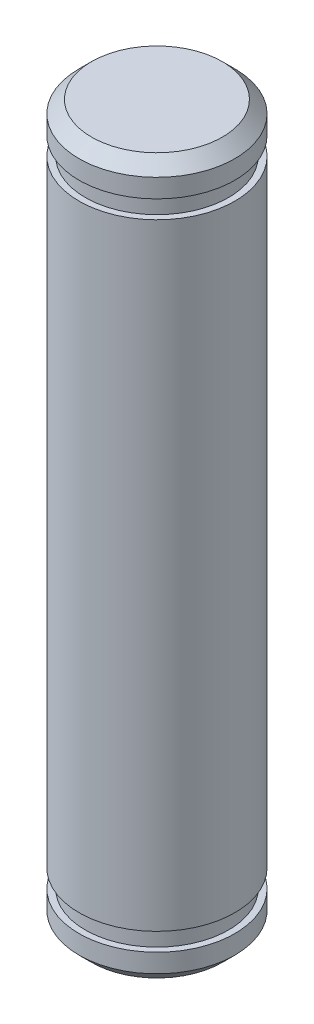
ISO-10303-21;
HEADER;
FILE_DESCRIPTION(('STEP AP214'),'2;1');
FILE_NAME('part.step','',(''),(''),'','','');
FILE_SCHEMA(('AUTOMOTIVE_DESIGN { 1 0 10303 214 1 1 1 1 }'));
ENDSEC;
DATA;
#1=APPLICATION_CONTEXT('core data for automotive mechanical design processes');
#2=APPLICATION_PROTOCOL_DEFINITION('international standard','automotive_design',2000,#1);
#3=PRODUCT_CONTEXT('',#1,'mechanical');
#4=PRODUCT('Part','Part','',(#3));
#5=PRODUCT_RELATED_PRODUCT_CATEGORY('part','',(#4));
#6=PRODUCT_DEFINITION_FORMATION('','',#4);
#7=PRODUCT_DEFINITION_CONTEXT('part definition',#1,'design');
#8=PRODUCT_DEFINITION('design','',#6,#7);
#9=PRODUCT_DEFINITION_SHAPE('','',#8);
#10=(LENGTH_UNIT() NAMED_UNIT(*) SI_UNIT(.MILLI.,.METRE.));
#11=(NAMED_UNIT(*) PLANE_ANGLE_UNIT() SI_UNIT($,.RADIAN.));
#12=(NAMED_UNIT(*) SI_UNIT($,.STERADIAN.) SOLID_ANGLE_UNIT());
#13=UNCERTAINTY_MEASURE_WITH_UNIT(LENGTH_MEASURE(1.E-05),#10,'distance_accuracy_value','');
#14=(GEOMETRIC_REPRESENTATION_CONTEXT(3) GLOBAL_UNCERTAINTY_ASSIGNED_CONTEXT((#13)) GLOBAL_UNIT_ASSIGNED_CONTEXT((#10,
#11,#12)) REPRESENTATION_CONTEXT('',''));
#15=CARTESIAN_POINT('',(0.,0.,0.));
#16=DIRECTION('',(0.,0.,1.));
#17=DIRECTION('',(1.,0.,0.));
#18=AXIS2_PLACEMENT_3D('',#15,#16,#17);
#19=CARTESIAN_POINT('',(0.,-14.5669,0.));
#20=DIRECTION('',(0.,-1.,0.));
#21=DIRECTION('',(1.,0.,0.));
#22=AXIS2_PLACEMENT_3D('',#19,#20,#21);
#23=PLANE('',#22);
#24=CARTESIAN_POINT('',(0.,-14.5669,0.));
#25=DIRECTION('',(0.,-1.,0.));
#26=DIRECTION('',(1.,0.,0.));
#27=AXIS2_PLACEMENT_3D('',#24,#25,#26);
#28=CIRCLE('',#27,2.66699999999991);
#29=CARTESIAN_POINT('',(2.66699999999983,-14.5669,0.));
#30=VERTEX_POINT('',#29);
#31=EDGE_CURVE('E56',#30,#30,#28,.T.);
#32=ORIENTED_EDGE('',*,*,#31,.T.);
#33=EDGE_LOOP('',(#32));
#34=FACE_BOUND('',#33,.T.);
#35=ADVANCED_FACE('F45',(#34),#23,.T.);
#36=CARTESIAN_POINT('',(0.,14.5669,0.));
#37=DIRECTION('',(0.,1.,0.));
#38=DIRECTION('',(-1.,0.,0.));
#39=AXIS2_PLACEMENT_3D('',#36,#37,#38);
#40=CYLINDRICAL_SURFACE('',#39,3.17499999999992);
#41=CARTESIAN_POINT('',(0.,-14.0589,0.));
#42=DIRECTION('',(0.,-1.,0.));
#43=DIRECTION('',(1.,0.,0.));
#44=AXIS2_PLACEMENT_3D('',#41,#42,#43);
#45=CIRCLE('',#44,3.17499999999992);
#46=CARTESIAN_POINT('',(3.17499999999984,-14.0589,0.));
#47=VERTEX_POINT('',#46);
#48=EDGE_CURVE('E60',#47,#47,#45,.F.);
#49=ORIENTED_EDGE('',*,*,#48,.T.);
#50=EDGE_LOOP('',(#49));
#51=FACE_BOUND('',#50,.T.);
#52=CARTESIAN_POINT('',(0.,-13.2969,0.));
#53=DIRECTION('',(0.,1.,0.));
#54=DIRECTION('',(-1.,0.,0.));
#55=AXIS2_PLACEMENT_3D('',#52,#53,#54);
#56=CIRCLE('',#55,3.17499999999992);
#57=CARTESIAN_POINT('',(-3.175,-13.2969,0.));
#58=VERTEX_POINT('',#57);
#59=EDGE_CURVE('E65',#58,#58,#56,.T.);
#60=ORIENTED_EDGE('',*,*,#59,.F.);
#61=EDGE_LOOP('',(#60));
#62=FACE_BOUND('',#61,.T.);
#63=ADVANCED_FACE('F107',(#51,#62),#40,.T.);
#64=CARTESIAN_POINT('',(-3.175,-13.2969,0.));
#65=DIRECTION('',(0.,1.,0.));
#66=DIRECTION('',(-1.,0.,0.));
#67=AXIS2_PLACEMENT_3D('',#64,#65,#66);
#68=PLANE('',#67);
#69=ORIENTED_EDGE('',*,*,#59,.T.);
#70=EDGE_LOOP('',(#69));
#71=FACE_BOUND('',#70,.T.);
#72=CARTESIAN_POINT('',(0.,-13.2969,0.));
#73=DIRECTION('',(0.,1.,0.));
#74=DIRECTION('',(-1.,0.,0.));
#75=AXIS2_PLACEMENT_3D('',#72,#73,#74);
#76=CIRCLE('',#75,2.92099999999992);
#77=CARTESIAN_POINT('',(-2.921,-13.2969,0.));
#78=VERTEX_POINT('',#77);
#79=EDGE_CURVE('E68',#78,#78,#76,.T.);
#80=ORIENTED_EDGE('',*,*,#79,.F.);
#81=EDGE_LOOP('',(#80));
#82=FACE_BOUND('',#81,.T.);
#83=ADVANCED_FACE('F113',(#71,#82),#68,.T.);
#84=CARTESIAN_POINT('',(0.,14.5669,0.));
#85=DIRECTION('',(0.,1.,0.));
#86=DIRECTION('',(-1.,0.,0.));
#87=AXIS2_PLACEMENT_3D('',#84,#85,#86);
#88=CYLINDRICAL_SURFACE('',#87,2.92099999999992);
#89=ORIENTED_EDGE('',*,*,#79,.T.);
#90=EDGE_LOOP('',(#89));
#91=FACE_BOUND('',#90,.T.);
#92=CARTESIAN_POINT('',(0.,-12.5603,0.));
#93=DIRECTION('',(0.,1.,0.));
#94=DIRECTION('',(-1.,0.,0.));
#95=AXIS2_PLACEMENT_3D('',#92,#93,#94);
#96=CIRCLE('',#95,2.92099999999992);
#97=CARTESIAN_POINT('',(-2.921,-12.5603,0.));
#98=VERTEX_POINT('',#97);
#99=EDGE_CURVE('E71',#98,#98,#96,.T.);
#100=ORIENTED_EDGE('',*,*,#99,.F.);
#101=EDGE_LOOP('',(#100));
#102=FACE_BOUND('',#101,.T.);
#103=ADVANCED_FACE('F134',(#91,#102),#88,.T.);
#104=CARTESIAN_POINT('',(-3.175,-12.5603,0.));
#105=DIRECTION('',(0.,-1.,0.));
#106=DIRECTION('',(1.,0.,0.));
#107=AXIS2_PLACEMENT_3D('',#104,#105,#106);
#108=PLANE('',#107);
#109=ORIENTED_EDGE('',*,*,#99,.T.);
#110=EDGE_LOOP('',(#109));
#111=FACE_BOUND('',#110,.T.);
#112=CARTESIAN_POINT('',(0.,-12.5603,0.));
#113=DIRECTION('',(0.,1.,0.));
#114=DIRECTION('',(-1.,0.,0.));
#115=AXIS2_PLACEMENT_3D('',#112,#113,#114);
#116=CIRCLE('',#115,3.17499999999992);
#117=CARTESIAN_POINT('',(-3.175,-12.5603,0.));
#118=VERTEX_POINT('',#117);
#119=EDGE_CURVE('E74',#118,#118,#116,.T.);
#120=ORIENTED_EDGE('',*,*,#119,.F.);
#121=EDGE_LOOP('',(#120));
#122=FACE_BOUND('',#121,.T.);
#123=ADVANCED_FACE('F139',(#111,#122),#108,.T.);
#124=CARTESIAN_POINT('',(0.,14.5669,0.));
#125=DIRECTION('',(0.,1.,0.));
#126=DIRECTION('',(-1.,0.,0.));
#127=AXIS2_PLACEMENT_3D('',#124,#125,#126);
#128=CYLINDRICAL_SURFACE('',#127,3.17499999999996);
#129=ORIENTED_EDGE('',*,*,#119,.T.);
#130=EDGE_LOOP('',(#129));
#131=FACE_BOUND('',#130,.T.);
#132=CARTESIAN_POINT('',(0.,12.5603,0.));
#133=DIRECTION('',(0.,1.,0.));
#134=DIRECTION('',(-1.,0.,0.));
#135=AXIS2_PLACEMENT_3D('',#132,#133,#134);
#136=CIRCLE('',#135,3.17499999999999);
#137=CARTESIAN_POINT('',(-3.175,12.5603,0.));
#138=VERTEX_POINT('',#137);
#139=EDGE_CURVE('E77',#138,#138,#136,.T.);
#140=ORIENTED_EDGE('',*,*,#139,.F.);
#141=EDGE_LOOP('',(#140));
#142=FACE_BOUND('',#141,.T.);
#143=ADVANCED_FACE('F145',(#131,#142),#128,.T.);
#144=CARTESIAN_POINT('',(-3.175,12.5603,0.));
#145=DIRECTION('',(0.,1.,0.));
#146=DIRECTION('',(-1.,0.,0.));
#147=AXIS2_PLACEMENT_3D('',#144,#145,#146);
#148=PLANE('',#147);
#149=ORIENTED_EDGE('',*,*,#139,.T.);
#150=EDGE_LOOP('',(#149));
#151=FACE_BOUND('',#150,.T.);
#152=CARTESIAN_POINT('',(0.,12.5603,0.));
#153=DIRECTION('',(0.,1.,0.));
#154=DIRECTION('',(-1.,0.,0.));
#155=AXIS2_PLACEMENT_3D('',#152,#153,#154);
#156=CIRCLE('',#155,2.92099999999999);
#157=CARTESIAN_POINT('',(-2.921,12.5603,0.));
#158=VERTEX_POINT('',#157);
#159=EDGE_CURVE('E80',#158,#158,#156,.T.);
#160=ORIENTED_EDGE('',*,*,#159,.F.);
#161=EDGE_LOOP('',(#160));
#162=FACE_BOUND('',#161,.T.);
#163=ADVANCED_FACE('F103',(#151,#162),#148,.T.);
#164=CARTESIAN_POINT('',(0.,14.5669,0.));
#165=DIRECTION('',(0.,1.,0.));
#166=DIRECTION('',(-1.,0.,0.));
#167=AXIS2_PLACEMENT_3D('',#164,#165,#166);
#168=CYLINDRICAL_SURFACE('',#167,2.921);
#169=ORIENTED_EDGE('',*,*,#159,.T.);
#170=EDGE_LOOP('',(#169));
#171=FACE_BOUND('',#170,.T.);
#172=CARTESIAN_POINT('',(0.,13.2969,0.));
#173=DIRECTION('',(0.,1.,0.));
#174=DIRECTION('',(-1.,0.,0.));
#175=AXIS2_PLACEMENT_3D('',#172,#173,#174);
#176=CIRCLE('',#175,2.921);
#177=CARTESIAN_POINT('',(-2.921,13.2969,0.));
#178=VERTEX_POINT('',#177);
#179=EDGE_CURVE('E83',#178,#178,#176,.T.);
#180=ORIENTED_EDGE('',*,*,#179,.F.);
#181=EDGE_LOOP('',(#180));
#182=FACE_BOUND('',#181,.T.);
#183=ADVANCED_FACE('F94',(#171,#182),#168,.T.);
#184=CARTESIAN_POINT('',(-3.175,13.2969,0.));
#185=DIRECTION('',(0.,-1.,0.));
#186=DIRECTION('',(1.,0.,0.));
#187=AXIS2_PLACEMENT_3D('',#184,#185,#186);
#188=PLANE('',#187);
#189=ORIENTED_EDGE('',*,*,#179,.T.);
#190=EDGE_LOOP('',(#189));
#191=FACE_BOUND('',#190,.T.);
#192=CARTESIAN_POINT('',(0.,13.2969,0.));
#193=DIRECTION('',(0.,1.,0.));
#194=DIRECTION('',(-1.,0.,0.));
#195=AXIS2_PLACEMENT_3D('',#192,#193,#194);
#196=CIRCLE('',#195,3.175);
#197=CARTESIAN_POINT('',(-3.175,13.2969,0.));
#198=VERTEX_POINT('',#197);
#199=EDGE_CURVE('E86',#198,#198,#196,.T.);
#200=ORIENTED_EDGE('',*,*,#199,.F.);
#201=EDGE_LOOP('',(#200));
#202=FACE_BOUND('',#201,.T.);
#203=ADVANCED_FACE('F92',(#191,#202),#188,.T.);
#204=CARTESIAN_POINT('',(0.,14.5669,0.));
#205=DIRECTION('',(0.,1.,0.));
#206=DIRECTION('',(-1.,0.,0.));
#207=AXIS2_PLACEMENT_3D('',#204,#205,#206);
#208=CYLINDRICAL_SURFACE('',#207,3.175);
#209=CARTESIAN_POINT('',(0.,14.0589,0.));
#210=DIRECTION('',(0.,1.,0.));
#211=DIRECTION('',(-1.,0.,0.));
#212=AXIS2_PLACEMENT_3D('',#209,#210,#211);
#213=CIRCLE('',#212,3.175);
#214=CARTESIAN_POINT('',(-3.175,14.0589,0.));
#215=VERTEX_POINT('',#214);
#216=EDGE_CURVE('E12',#215,#215,#213,.F.);
#217=ORIENTED_EDGE('',*,*,#216,.T.);
#218=EDGE_LOOP('',(#217));
#219=FACE_BOUND('',#218,.T.);
#220=ORIENTED_EDGE('',*,*,#199,.T.);
#221=EDGE_LOOP('',(#220));
#222=FACE_BOUND('',#221,.T.);
#223=ADVANCED_FACE('F90',(#219,#222),#208,.T.);
#224=CARTESIAN_POINT('',(0.,14.5669,0.));
#225=DIRECTION('',(0.,1.,0.));
#226=DIRECTION('',(-1.,0.,0.));
#227=AXIS2_PLACEMENT_3D('',#224,#225,#226);
#228=PLANE('',#227);
#229=CARTESIAN_POINT('',(0.,14.5669,0.));
#230=DIRECTION('',(0.,1.,0.));
#231=DIRECTION('',(-1.,0.,0.));
#232=AXIS2_PLACEMENT_3D('',#229,#230,#231);
#233=CIRCLE('',#232,2.66699999999999);
#234=CARTESIAN_POINT('',(-2.66699999999999,14.5669,0.));
#235=VERTEX_POINT('',#234);
#236=EDGE_CURVE('E52',#235,#235,#233,.T.);
#237=ORIENTED_EDGE('',*,*,#236,.T.);
#238=EDGE_LOOP('',(#237));
#239=FACE_BOUND('',#238,.T.);
#240=ADVANCED_FACE('F101',(#239),#228,.T.);
#241=CARTESIAN_POINT('',(0.,-14.0589,0.));
#242=DIRECTION('',(0.,1.,0.));
#243=DIRECTION('',(-1.,0.,0.));
#244=AXIS2_PLACEMENT_3D('',#241,#242,#243);
#245=CONICAL_SURFACE('',#244,3.17499999999992,0.785398163397451);
#246=ORIENTED_EDGE('',*,*,#31,.F.);
#247=EDGE_LOOP('',(#246));
#248=FACE_BOUND('',#247,.T.);
#249=ORIENTED_EDGE('',*,*,#48,.F.);
#250=EDGE_LOOP('',(#249));
#251=FACE_BOUND('',#250,.T.);
#252=ADVANCED_FACE('F117',(#248,#251),#245,.T.);
#253=CARTESIAN_POINT('',(0.,14.5669,0.));
#254=DIRECTION('',(0.,-1.,0.));
#255=DIRECTION('',(1.,0.,0.));
#256=AXIS2_PLACEMENT_3D('',#253,#254,#255);
#257=CONICAL_SURFACE('',#256,2.66699999999999,0.785398163397444);
#258=ORIENTED_EDGE('',*,*,#216,.F.);
#259=EDGE_LOOP('',(#258));
#260=FACE_BOUND('',#259,.T.);
#261=ORIENTED_EDGE('',*,*,#236,.F.);
#262=EDGE_LOOP('',(#261));
#263=FACE_BOUND('',#262,.T.);
#264=ADVANCED_FACE('F47',(#260,#263),#257,.T.);
#265=CLOSED_SHELL('',(#35,#63,#83,#103,#123,#143,#163,#183,#203,#223,#240,#252,#264));
#266=MANIFOLD_SOLID_BREP('B2',#265);
#267=ADVANCED_BREP_SHAPE_REPRESENTATION('',(#18,#266),#14);
#268=SHAPE_DEFINITION_REPRESENTATION(#9,#267);
ENDSEC;
END-ISO-10303-21;
